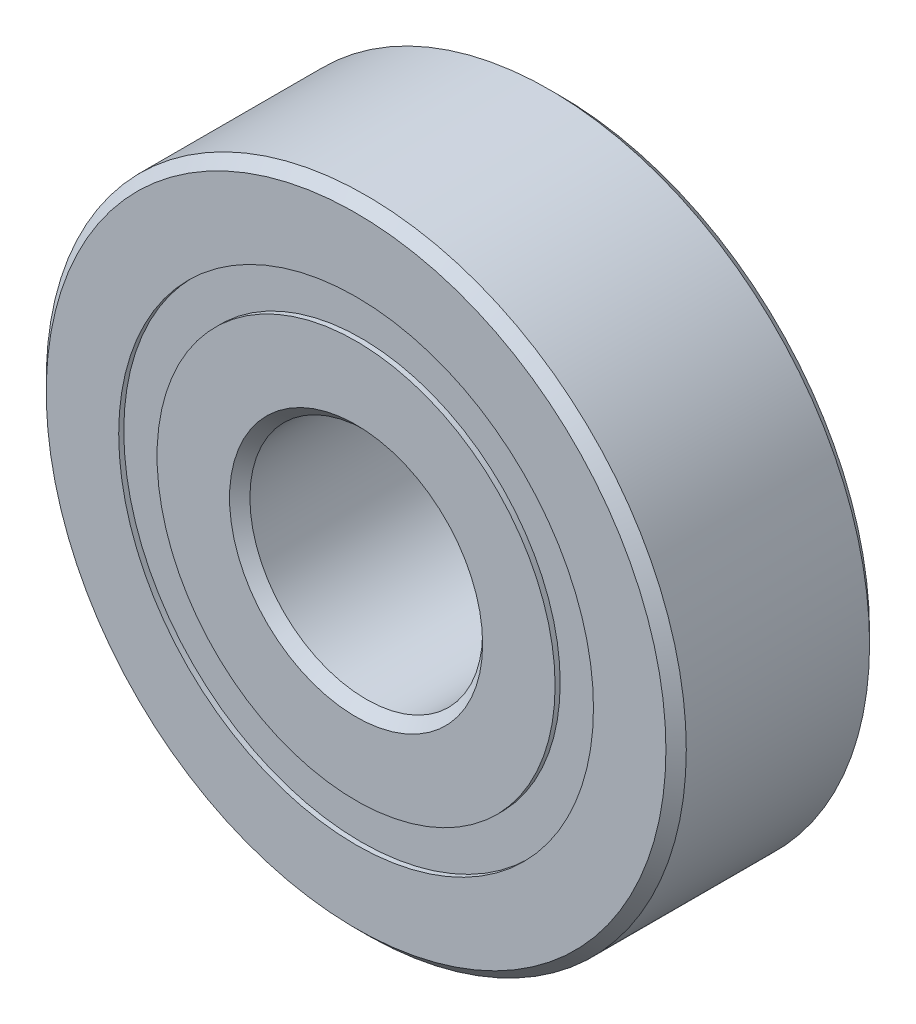
ISO-10303-21;
HEADER;
FILE_DESCRIPTION(('STEP AP214'),'2;1');
FILE_NAME('part.step','',(''),(''),'','','');
FILE_SCHEMA(('AUTOMOTIVE_DESIGN { 1 0 10303 214 1 1 1 1 }'));
ENDSEC;
DATA;
#1=APPLICATION_CONTEXT('core data for automotive mechanical design processes');
#2=APPLICATION_PROTOCOL_DEFINITION('international standard','automotive_design',2000,#1);
#3=PRODUCT_CONTEXT('',#1,'mechanical');
#4=PRODUCT('Part','Part','',(#3));
#5=PRODUCT_RELATED_PRODUCT_CATEGORY('part','',(#4));
#6=PRODUCT_DEFINITION_FORMATION('','',#4);
#7=PRODUCT_DEFINITION_CONTEXT('part definition',#1,'design');
#8=PRODUCT_DEFINITION('design','',#6,#7);
#9=PRODUCT_DEFINITION_SHAPE('','',#8);
#10=(LENGTH_UNIT() NAMED_UNIT(*) SI_UNIT(.MILLI.,.METRE.));
#11=(NAMED_UNIT(*) PLANE_ANGLE_UNIT() SI_UNIT($,.RADIAN.));
#12=(NAMED_UNIT(*) SI_UNIT($,.STERADIAN.) SOLID_ANGLE_UNIT());
#13=UNCERTAINTY_MEASURE_WITH_UNIT(LENGTH_MEASURE(1.E-05),#10,'distance_accuracy_value','');
#14=(GEOMETRIC_REPRESENTATION_CONTEXT(3) GLOBAL_UNCERTAINTY_ASSIGNED_CONTEXT((#13)) GLOBAL_UNIT_ASSIGNED_CONTEXT((#10,
#11,#12)) REPRESENTATION_CONTEXT('',''));
#15=CARTESIAN_POINT('',(0.,0.,0.));
#16=DIRECTION('',(0.,0.,1.));
#17=DIRECTION('',(1.,0.,0.));
#18=AXIS2_PLACEMENT_3D('',#15,#16,#17);
#19=CARTESIAN_POINT('',(0.,8.15934065934066,-3.325));
#20=DIRECTION('',(0.,0.,1.));
#21=DIRECTION('',(1.,0.,0.));
#22=AXIS2_PLACEMENT_3D('',#19,#20,#21);
#23=PLANE('',#22);
#24=CARTESIAN_POINT('',(0.,0.,-3.325));
#25=DIRECTION('',(0.,0.,1.));
#26=DIRECTION('',(1.,0.,0.));
#27=AXIS2_PLACEMENT_3D('',#24,#25,#26);
#28=CIRCLE('',#27,8.15934065934066);
#29=CARTESIAN_POINT('',(8.15934065934066,0.,-3.325));
#30=VERTEX_POINT('',#29);
#31=EDGE_CURVE('E55',#30,#30,#28,.T.);
#32=ORIENTED_EDGE('',*,*,#31,.F.);
#33=EDGE_LOOP('',(#32));
#34=FACE_BOUND('',#33,.T.);
#35=CARTESIAN_POINT('',(0.,0.,-3.325));
#36=DIRECTION('',(0.,0.,1.));
#37=DIRECTION('',(1.,0.,0.));
#38=AXIS2_PLACEMENT_3D('',#35,#36,#37);
#39=CIRCLE('',#38,6.84065934065934);
#40=CARTESIAN_POINT('',(6.84065934065934,0.,-3.325));
#41=VERTEX_POINT('',#40);
#42=EDGE_CURVE('E11',#41,#41,#39,.T.);
#43=ORIENTED_EDGE('',*,*,#42,.T.);
#44=EDGE_LOOP('',(#43));
#45=FACE_BOUND('',#44,.T.);
#46=ADVANCED_FACE('F41',(#34,#45),#23,.F.);
#47=CARTESIAN_POINT('',(0.,0.,3.5));
#48=DIRECTION('',(0.,0.,1.));
#49=DIRECTION('',(1.,0.,0.));
#50=AXIS2_PLACEMENT_3D('',#47,#48,#49);
#51=CYLINDRICAL_SURFACE('',#50,6.84065934065934);
#52=ORIENTED_EDGE('',*,*,#42,.F.);
#53=EDGE_LOOP('',(#52));
#54=FACE_BOUND('',#53,.T.);
#55=CARTESIAN_POINT('',(0.,0.,-1.68952158656808));
#56=DIRECTION('',(0.,0.,1.));
#57=DIRECTION('',(1.,0.,0.));
#58=AXIS2_PLACEMENT_3D('',#55,#56,#57);
#59=CIRCLE('',#58,6.84065934065934);
#60=CARTESIAN_POINT('',(6.84065934065934,0.,-1.68952158656808));
#61=VERTEX_POINT('',#60);
#62=EDGE_CURVE('E47',#61,#61,#59,.T.);
#63=ORIENTED_EDGE('',*,*,#62,.T.);
#64=EDGE_LOOP('',(#63));
#65=FACE_BOUND('',#64,.T.);
#66=ADVANCED_FACE('F64',(#54,#65),#51,.F.);
#67=CARTESIAN_POINT('',(0.,8.15934065934066,-1.68952158656808));
#68=DIRECTION('',(0.,0.,-1.));
#69=DIRECTION('',(-1.,0.,0.));
#70=AXIS2_PLACEMENT_3D('',#67,#68,#69);
#71=PLANE('',#70);
#72=ORIENTED_EDGE('',*,*,#62,.F.);
#73=EDGE_LOOP('',(#72));
#74=FACE_BOUND('',#73,.T.);
#75=CARTESIAN_POINT('',(0.,0.,-1.68952158656808));
#76=DIRECTION('',(0.,0.,1.));
#77=DIRECTION('',(1.,0.,0.));
#78=AXIS2_PLACEMENT_3D('',#75,#76,#77);
#79=CIRCLE('',#78,8.15934065934066);
#80=CARTESIAN_POINT('',(8.15934065934066,0.,-1.68952158656808));
#81=VERTEX_POINT('',#80);
#82=EDGE_CURVE('E51',#81,#81,#79,.T.);
#83=ORIENTED_EDGE('',*,*,#82,.T.);
#84=EDGE_LOOP('',(#83));
#85=FACE_BOUND('',#84,.T.);
#86=ADVANCED_FACE('F68',(#74,#85),#71,.F.);
#87=CARTESIAN_POINT('',(0.,0.,3.5));
#88=DIRECTION('',(0.,0.,1.));
#89=DIRECTION('',(1.,0.,0.));
#90=AXIS2_PLACEMENT_3D('',#87,#88,#89);
#91=CYLINDRICAL_SURFACE('',#90,8.15934065934066);
#92=ORIENTED_EDGE('',*,*,#82,.F.);
#93=EDGE_LOOP('',(#92));
#94=FACE_BOUND('',#93,.T.);
#95=ORIENTED_EDGE('',*,*,#31,.T.);
#96=EDGE_LOOP('',(#95));
#97=FACE_BOUND('',#96,.T.);
#98=ADVANCED_FACE('F61',(#94,#97),#91,.T.);
#99=CLOSED_SHELL('',(#46,#66,#86,#98));
#100=MANIFOLD_SOLID_BREP('B2',#99);
#101=CARTESIAN_POINT('',(0.,8.15934065934066,3.325));
#102=DIRECTION('',(0.,0.,-1.));
#103=DIRECTION('',(-1.,0.,0.));
#104=AXIS2_PLACEMENT_3D('',#101,#102,#103);
#105=PLANE('',#104);
#106=CARTESIAN_POINT('',(0.,0.,3.325));
#107=DIRECTION('',(0.,0.,1.));
#108=DIRECTION('',(1.,0.,0.));
#109=AXIS2_PLACEMENT_3D('',#106,#107,#108);
#110=CIRCLE('',#109,6.84065934065934);
#111=CARTESIAN_POINT('',(6.84065934065934,0.,3.325));
#112=VERTEX_POINT('',#111);
#113=EDGE_CURVE('E40',#112,#112,#110,.T.);
#114=ORIENTED_EDGE('',*,*,#113,.F.);
#115=EDGE_LOOP('',(#114));
#116=FACE_BOUND('',#115,.T.);
#117=CARTESIAN_POINT('',(0.,0.,3.325));
#118=DIRECTION('',(0.,0.,1.));
#119=DIRECTION('',(1.,0.,0.));
#120=AXIS2_PLACEMENT_3D('',#117,#118,#119);
#121=CIRCLE('',#120,8.15934065934066);
#122=CARTESIAN_POINT('',(8.15934065934066,0.,3.325));
#123=VERTEX_POINT('',#122);
#124=EDGE_CURVE('E122',#123,#123,#121,.T.);
#125=ORIENTED_EDGE('',*,*,#124,.T.);
#126=EDGE_LOOP('',(#125));
#127=FACE_BOUND('',#126,.T.);
#128=ADVANCED_FACE('F108',(#116,#127),#105,.F.);
#129=CARTESIAN_POINT('',(0.,0.,3.5));
#130=DIRECTION('',(0.,0.,1.));
#131=DIRECTION('',(1.,0.,0.));
#132=AXIS2_PLACEMENT_3D('',#129,#130,#131);
#133=CYLINDRICAL_SURFACE('',#132,6.84065934065934);
#134=CARTESIAN_POINT('',(0.,0.,1.68952158656808));
#135=DIRECTION('',(0.,0.,1.));
#136=DIRECTION('',(1.,0.,0.));
#137=AXIS2_PLACEMENT_3D('',#134,#135,#136);
#138=CIRCLE('',#137,6.84065934065934);
#139=CARTESIAN_POINT('',(6.84065934065934,0.,1.68952158656808));
#140=VERTEX_POINT('',#139);
#141=EDGE_CURVE('E114',#140,#140,#138,.T.);
#142=ORIENTED_EDGE('',*,*,#141,.F.);
#143=EDGE_LOOP('',(#142));
#144=FACE_BOUND('',#143,.T.);
#145=ORIENTED_EDGE('',*,*,#113,.T.);
#146=EDGE_LOOP('',(#145));
#147=FACE_BOUND('',#146,.T.);
#148=ADVANCED_FACE('F137',(#144,#147),#133,.F.);
#149=CARTESIAN_POINT('',(0.,8.15934065934066,1.68952158656808));
#150=DIRECTION('',(0.,0.,1.));
#151=DIRECTION('',(1.,0.,0.));
#152=AXIS2_PLACEMENT_3D('',#149,#150,#151);
#153=PLANE('',#152);
#154=CARTESIAN_POINT('',(0.,0.,1.68952158656808));
#155=DIRECTION('',(0.,0.,1.));
#156=DIRECTION('',(1.,0.,0.));
#157=AXIS2_PLACEMENT_3D('',#154,#155,#156);
#158=CIRCLE('',#157,8.15934065934066);
#159=CARTESIAN_POINT('',(8.15934065934066,0.,1.68952158656808));
#160=VERTEX_POINT('',#159);
#161=EDGE_CURVE('E118',#160,#160,#158,.T.);
#162=ORIENTED_EDGE('',*,*,#161,.F.);
#163=EDGE_LOOP('',(#162));
#164=FACE_BOUND('',#163,.T.);
#165=ORIENTED_EDGE('',*,*,#141,.T.);
#166=EDGE_LOOP('',(#165));
#167=FACE_BOUND('',#166,.T.);
#168=ADVANCED_FACE('F132',(#164,#167),#153,.F.);
#169=CARTESIAN_POINT('',(0.,0.,3.5));
#170=DIRECTION('',(0.,0.,1.));
#171=DIRECTION('',(1.,0.,0.));
#172=AXIS2_PLACEMENT_3D('',#169,#170,#171);
#173=CYLINDRICAL_SURFACE('',#172,8.15934065934066);
#174=ORIENTED_EDGE('',*,*,#124,.F.);
#175=EDGE_LOOP('',(#174));
#176=FACE_BOUND('',#175,.T.);
#177=ORIENTED_EDGE('',*,*,#161,.T.);
#178=EDGE_LOOP('',(#177));
#179=FACE_BOUND('',#178,.T.);
#180=ADVANCED_FACE('F129',(#176,#179),#173,.T.);
#181=CLOSED_SHELL('',(#128,#148,#168,#180));
#182=MANIFOLD_SOLID_BREP('B6',#181);
#183=CARTESIAN_POINT('',(-3.2541280433816,6.75726650926819,0.));
#184=DIRECTION('',(0.,0.,1.));
#185=DIRECTION('',(-0.433883739117546,0.900968867902425,0.));
#186=AXIS2_PLACEMENT_3D('',#183,#184,#185);
#187=SPHERICAL_SURFACE('',#186,1.68952158656808);
#188=CARTESIAN_POINT('',(-3.2541280433816,6.75726650926819,1.68952158656808));
#189=VERTEX_POINT('',#188);
#190=VERTEX_LOOP('',#189);
#191=FACE_BOUND('',#190,.T.);
#192=ADVANCED_FACE('F175',(#191),#187,.T.);
#193=CLOSED_SHELL('',(#192));
#194=MANIFOLD_SOLID_BREP('B35',#193);
#195=CARTESIAN_POINT('',(-5.86373611851017,4.67617351394057,0.));
#196=DIRECTION('',(0.,0.,1.));
#197=DIRECTION('',(-0.781831482468022,0.623489801858743,0.));
#198=AXIS2_PLACEMENT_3D('',#195,#196,#197);
#199=SPHERICAL_SURFACE('',#198,1.68952158656808);
#200=CARTESIAN_POINT('',(-5.86373611851017,4.67617351394057,1.68952158656808));
#201=VERTEX_POINT('',#200);
#202=VERTEX_LOOP('',#201);
#203=FACE_BOUND('',#202,.T.);
#204=ADVANCED_FACE('F195',(#203),#199,.T.);
#205=CLOSED_SHELL('',(#204));
#206=MANIFOLD_SOLID_BREP('B104',#205);
#207=CARTESIAN_POINT('',(-7.31195934136366,1.66890700467243,0.));
#208=DIRECTION('',(0.,0.,1.));
#209=DIRECTION('',(-0.974927912181821,0.222520933956325,0.));
#210=AXIS2_PLACEMENT_3D('',#207,#208,#209);
#211=SPHERICAL_SURFACE('',#210,1.68952158656808);
#212=CARTESIAN_POINT('',(-7.31195934136366,1.66890700467243,1.68952158656808));
#213=VERTEX_POINT('',#212);
#214=VERTEX_LOOP('',#213);
#215=FACE_BOUND('',#214,.T.);
#216=ADVANCED_FACE('F215',(#215),#211,.T.);
#217=CLOSED_SHELL('',(#216));
#218=MANIFOLD_SOLID_BREP('B171',#217);
#219=CARTESIAN_POINT('',(-7.31195934136369,-1.66890700467229,0.));
#220=DIRECTION('',(0.,0.,1.));
#221=DIRECTION('',(-0.974927912181826,-0.222520933956305,0.));
#222=AXIS2_PLACEMENT_3D('',#219,#220,#221);
#223=SPHERICAL_SURFACE('',#222,1.68952158656808);
#224=CARTESIAN_POINT('',(-7.31195934136369,-1.66890700467229,1.68952158656808));
#225=VERTEX_POINT('',#224);
#226=VERTEX_LOOP('',#225);
#227=FACE_BOUND('',#226,.T.);
#228=ADVANCED_FACE('F235',(#227),#223,.T.);
#229=CLOSED_SHELL('',(#228));
#230=MANIFOLD_SOLID_BREP('B191',#229);
#231=CARTESIAN_POINT('',(-5.86373611851026,-4.67617351394045,0.));
#232=DIRECTION('',(0.,0.,1.));
#233=DIRECTION('',(-0.781831482468035,-0.623489801858727,0.));
#234=AXIS2_PLACEMENT_3D('',#231,#232,#233);
#235=SPHERICAL_SURFACE('',#234,1.68952158656808);
#236=CARTESIAN_POINT('',(-5.86373611851026,-4.67617351394045,1.68952158656808));
#237=VERTEX_POINT('',#236);
#238=VERTEX_LOOP('',#237);
#239=FACE_BOUND('',#238,.T.);
#240=ADVANCED_FACE('F255',(#239),#235,.T.);
#241=CLOSED_SHELL('',(#240));
#242=MANIFOLD_SOLID_BREP('B211',#241);
#243=CARTESIAN_POINT('',(-3.25412804338174,-6.75726650926812,0.));
#244=DIRECTION('',(0.,0.,1.));
#245=DIRECTION('',(-0.433883739117565,-0.900968867902416,0.));
#246=AXIS2_PLACEMENT_3D('',#243,#244,#245);
#247=SPHERICAL_SURFACE('',#246,1.68952158656808);
#248=CARTESIAN_POINT('',(-3.25412804338174,-6.75726650926812,1.68952158656808));
#249=VERTEX_POINT('',#248);
#250=VERTEX_LOOP('',#249);
#251=FACE_BOUND('',#250,.T.);
#252=ADVANCED_FACE('F275',(#251),#247,.T.);
#253=CLOSED_SHELL('',(#252));
#254=MANIFOLD_SOLID_BREP('B231',#253);
#255=CARTESIAN_POINT('',(0.,-7.5,0.));
#256=DIRECTION('',(0.,0.,1.));
#257=DIRECTION('',(0.,-1.,0.));
#258=AXIS2_PLACEMENT_3D('',#255,#256,#257);
#259=SPHERICAL_SURFACE('',#258,1.68952158656808);
#260=CARTESIAN_POINT('',(0.,-7.5,1.68952158656808));
#261=VERTEX_POINT('',#260);
#262=VERTEX_LOOP('',#261);
#263=FACE_BOUND('',#262,.T.);
#264=ADVANCED_FACE('F295',(#263),#259,.T.);
#265=CLOSED_SHELL('',(#264));
#266=MANIFOLD_SOLID_BREP('B251',#265);
#267=CARTESIAN_POINT('',(3.25412804338164,-6.75726650926816,0.));
#268=DIRECTION('',(0.,0.,1.));
#269=DIRECTION('',(0.433883739117553,-0.900968867902422,0.));
#270=AXIS2_PLACEMENT_3D('',#267,#268,#269);
#271=SPHERICAL_SURFACE('',#270,1.68952158656808);
#272=CARTESIAN_POINT('',(3.25412804338164,-6.75726650926816,1.68952158656808));
#273=VERTEX_POINT('',#272);
#274=VERTEX_LOOP('',#273);
#275=FACE_BOUND('',#274,.T.);
#276=ADVANCED_FACE('F315',(#275),#271,.T.);
#277=CLOSED_SHELL('',(#276));
#278=MANIFOLD_SOLID_BREP('B271',#277);
#279=CARTESIAN_POINT('',(5.8637361185102,-4.67617351394053,0.));
#280=DIRECTION('',(0.,0.,1.));
#281=DIRECTION('',(0.781831482468027,-0.623489801858737,0.));
#282=AXIS2_PLACEMENT_3D('',#279,#280,#281);
#283=SPHERICAL_SURFACE('',#282,1.68952158656808);
#284=CARTESIAN_POINT('',(5.8637361185102,-4.67617351394053,1.68952158656808));
#285=VERTEX_POINT('',#284);
#286=VERTEX_LOOP('',#285);
#287=FACE_BOUND('',#286,.T.);
#288=ADVANCED_FACE('F335',(#287),#283,.T.);
#289=CLOSED_SHELL('',(#288));
#290=MANIFOLD_SOLID_BREP('B291',#289);
#291=CARTESIAN_POINT('',(7.31195934136367,-1.66890700467239,0.));
#292=DIRECTION('',(0.,0.,1.));
#293=DIRECTION('',(0.974927912181823,-0.222520933956318,0.));
#294=AXIS2_PLACEMENT_3D('',#291,#292,#293);
#295=SPHERICAL_SURFACE('',#294,1.68952158656808);
#296=CARTESIAN_POINT('',(7.31195934136367,-1.66890700467239,1.68952158656808));
#297=VERTEX_POINT('',#296);
#298=VERTEX_LOOP('',#297);
#299=FACE_BOUND('',#298,.T.);
#300=ADVANCED_FACE('F355',(#299),#295,.T.);
#301=CLOSED_SHELL('',(#300));
#302=MANIFOLD_SOLID_BREP('B311',#301);
#303=CARTESIAN_POINT('',(7.31195934136368,1.66890700467234,0.));
#304=DIRECTION('',(0.,0.,1.));
#305=DIRECTION('',(0.974927912181824,0.222520933956311,0.));
#306=AXIS2_PLACEMENT_3D('',#303,#304,#305);
#307=SPHERICAL_SURFACE('',#306,1.68952158656808);
#308=CARTESIAN_POINT('',(7.31195934136368,1.66890700467234,1.68952158656808));
#309=VERTEX_POINT('',#308);
#310=VERTEX_LOOP('',#309);
#311=FACE_BOUND('',#310,.T.);
#312=ADVANCED_FACE('F375',(#311),#307,.T.);
#313=CLOSED_SHELL('',(#312));
#314=MANIFOLD_SOLID_BREP('B331',#313);
#315=CARTESIAN_POINT('',(5.86373611851023,4.67617351394049,0.));
#316=DIRECTION('',(0.,0.,1.));
#317=DIRECTION('',(0.781831482468031,0.623489801858732,0.));
#318=AXIS2_PLACEMENT_3D('',#315,#316,#317);
#319=SPHERICAL_SURFACE('',#318,1.68952158656808);
#320=CARTESIAN_POINT('',(5.86373611851023,4.67617351394049,1.68952158656808));
#321=VERTEX_POINT('',#320);
#322=VERTEX_LOOP('',#321);
#323=FACE_BOUND('',#322,.T.);
#324=ADVANCED_FACE('F395',(#323),#319,.T.);
#325=CLOSED_SHELL('',(#324));
#326=MANIFOLD_SOLID_BREP('B351',#325);
#327=CARTESIAN_POINT('',(3.25412804338169,6.75726650926814,0.));
#328=DIRECTION('',(0.,0.,1.));
#329=DIRECTION('',(0.433883739117559,0.900968867902419,0.));
#330=AXIS2_PLACEMENT_3D('',#327,#328,#329);
#331=SPHERICAL_SURFACE('',#330,1.68952158656808);
#332=CARTESIAN_POINT('',(3.25412804338169,6.75726650926814,1.68952158656808));
#333=VERTEX_POINT('',#332);
#334=VERTEX_LOOP('',#333);
#335=FACE_BOUND('',#334,.T.);
#336=ADVANCED_FACE('F415',(#335),#331,.T.);
#337=CLOSED_SHELL('',(#336));
#338=MANIFOLD_SOLID_BREP('B371',#337);
#339=CARTESIAN_POINT('',(0.,7.5,0.));
#340=DIRECTION('',(0.,0.,1.));
#341=DIRECTION('',(0.,1.,0.));
#342=AXIS2_PLACEMENT_3D('',#339,#340,#341);
#343=SPHERICAL_SURFACE('',#342,1.68952158656808);
#344=CARTESIAN_POINT('',(0.,7.5,1.68952158656808));
#345=VERTEX_POINT('',#344);
#346=VERTEX_LOOP('',#345);
#347=FACE_BOUND('',#346,.T.);
#348=ADVANCED_FACE('F437',(#347),#343,.T.);
#349=CLOSED_SHELL('',(#348));
#350=MANIFOLD_SOLID_BREP('B391',#349);
#351=CARTESIAN_POINT('',(0.,6.84065934065934,3.5));
#352=DIRECTION('',(0.,0.,-1.));
#353=DIRECTION('',(-1.,0.,0.));
#354=AXIS2_PLACEMENT_3D('',#351,#352,#353);
#355=PLANE('',#354);
#356=CARTESIAN_POINT('',(0.,0.,3.5));
#357=DIRECTION('',(0.,0.,1.));
#358=DIRECTION('',(1.,0.,0.));
#359=AXIS2_PLACEMENT_3D('',#356,#357,#358);
#360=CIRCLE('',#359,4.35);
#361=CARTESIAN_POINT('',(4.35,0.,3.5));
#362=VERTEX_POINT('',#361);
#363=EDGE_CURVE('E484',#362,#362,#360,.T.);
#364=ORIENTED_EDGE('',*,*,#363,.F.);
#365=EDGE_LOOP('',(#364));
#366=FACE_BOUND('',#365,.T.);
#367=CARTESIAN_POINT('',(0.,0.,3.5));
#368=DIRECTION('',(0.,0.,1.));
#369=DIRECTION('',(1.,0.,0.));
#370=AXIS2_PLACEMENT_3D('',#367,#368,#369);
#371=CIRCLE('',#370,6.84065934065934);
#372=CARTESIAN_POINT('',(6.84065934065934,0.,3.5));
#373=VERTEX_POINT('',#372);
#374=EDGE_CURVE('E436',#373,#373,#371,.T.);
#375=ORIENTED_EDGE('',*,*,#374,.T.);
#376=EDGE_LOOP('',(#375));
#377=FACE_BOUND('',#376,.T.);
#378=ADVANCED_FACE('F456',(#366,#377),#355,.F.);
#379=CARTESIAN_POINT('',(0.,0.,3.5));
#380=DIRECTION('',(0.,0.,1.));
#381=DIRECTION('',(1.,0.,0.));
#382=AXIS2_PLACEMENT_3D('',#379,#380,#381);
#383=CYLINDRICAL_SURFACE('',#382,6.84065934065934);
#384=ORIENTED_EDGE('',*,*,#374,.F.);
#385=EDGE_LOOP('',(#384));
#386=FACE_BOUND('',#385,.T.);
#387=CARTESIAN_POINT('',(0.,0.,1.55555555555556));
#388=DIRECTION('',(0.,0.,1.));
#389=DIRECTION('',(1.,0.,0.));
#390=AXIS2_PLACEMENT_3D('',#387,#388,#389);
#391=CIRCLE('',#390,6.84065934065934);
#392=CARTESIAN_POINT('',(6.84065934065934,0.,1.55555555555556));
#393=VERTEX_POINT('',#392);
#394=EDGE_CURVE('E462',#393,#393,#391,.T.);
#395=ORIENTED_EDGE('',*,*,#394,.T.);
#396=EDGE_LOOP('',(#395));
#397=FACE_BOUND('',#396,.T.);
#398=ADVANCED_FACE('F491',(#386,#397),#383,.T.);
#399=CARTESIAN_POINT('',(0.,0.,0.));
#400=DIRECTION('',(0.,0.,1.));
#401=DIRECTION('',(1.,0.,0.));
#402=AXIS2_PLACEMENT_3D('',#399,#400,#401);
#403=TOROIDAL_SURFACE('',#402,7.49999999999999,1.68952158656808);
#404=ORIENTED_EDGE('',*,*,#394,.F.);
#405=EDGE_LOOP('',(#404));
#406=FACE_BOUND('',#405,.T.);
#407=CARTESIAN_POINT('',(0.,0.,-1.55555555555556));
#408=DIRECTION('',(0.,0.,1.));
#409=DIRECTION('',(1.,0.,0.));
#410=AXIS2_PLACEMENT_3D('',#407,#408,#409);
#411=CIRCLE('',#410,6.84065934065934);
#412=CARTESIAN_POINT('',(6.84065934065934,0.,-1.55555555555556));
#413=VERTEX_POINT('',#412);
#414=EDGE_CURVE('E466',#413,#413,#411,.T.);
#415=ORIENTED_EDGE('',*,*,#414,.T.);
#416=EDGE_LOOP('',(#415));
#417=FACE_BOUND('',#416,.T.);
#418=ADVANCED_FACE('F495',(#406,#417),#403,.F.);
#419=CARTESIAN_POINT('',(0.,0.,3.5));
#420=DIRECTION('',(0.,0.,1.));
#421=DIRECTION('',(1.,0.,0.));
#422=AXIS2_PLACEMENT_3D('',#419,#420,#421);
#423=CYLINDRICAL_SURFACE('',#422,6.84065934065934);
#424=ORIENTED_EDGE('',*,*,#414,.F.);
#425=EDGE_LOOP('',(#424));
#426=FACE_BOUND('',#425,.T.);
#427=CARTESIAN_POINT('',(0.,0.,-3.5));
#428=DIRECTION('',(0.,0.,1.));
#429=DIRECTION('',(1.,0.,0.));
#430=AXIS2_PLACEMENT_3D('',#427,#428,#429);
#431=CIRCLE('',#430,6.84065934065934);
#432=CARTESIAN_POINT('',(6.84065934065934,0.,-3.5));
#433=VERTEX_POINT('',#432);
#434=EDGE_CURVE('E470',#433,#433,#431,.T.);
#435=ORIENTED_EDGE('',*,*,#434,.T.);
#436=EDGE_LOOP('',(#435));
#437=FACE_BOUND('',#436,.T.);
#438=ADVANCED_FACE('F500',(#426,#437),#423,.T.);
#439=CARTESIAN_POINT('',(0.,4.35,-3.5));
#440=DIRECTION('',(0.,0.,1.));
#441=DIRECTION('',(1.,0.,0.));
#442=AXIS2_PLACEMENT_3D('',#439,#440,#441);
#443=PLANE('',#442);
#444=ORIENTED_EDGE('',*,*,#434,.F.);
#445=EDGE_LOOP('',(#444));
#446=FACE_BOUND('',#445,.T.);
#447=CARTESIAN_POINT('',(0.,0.,-3.5));
#448=DIRECTION('',(0.,0.,1.));
#449=DIRECTION('',(1.,0.,0.));
#450=AXIS2_PLACEMENT_3D('',#447,#448,#449);
#451=CIRCLE('',#450,4.35);
#452=CARTESIAN_POINT('',(4.35,0.,-3.5));
#453=VERTEX_POINT('',#452);
#454=EDGE_CURVE('E475',#453,#453,#451,.T.);
#455=ORIENTED_EDGE('',*,*,#454,.T.);
#456=EDGE_LOOP('',(#455));
#457=FACE_BOUND('',#456,.T.);
#458=ADVANCED_FACE('F506',(#446,#457),#443,.F.);
#459=CARTESIAN_POINT('',(0.,0.,-3.15));
#460=DIRECTION('',(0.,0.,-1.));
#461=DIRECTION('',(-1.,0.,0.));
#462=AXIS2_PLACEMENT_3D('',#459,#460,#461);
#463=CONICAL_SURFACE('',#462,4.,0.785398163397448);
#464=ORIENTED_EDGE('',*,*,#454,.F.);
#465=EDGE_LOOP('',(#464));
#466=FACE_BOUND('',#465,.T.);
#467=CARTESIAN_POINT('',(0.,0.,-3.15));
#468=DIRECTION('',(0.,0.,1.));
#469=DIRECTION('',(1.,0.,0.));
#470=AXIS2_PLACEMENT_3D('',#467,#468,#469);
#471=CIRCLE('',#470,4.);
#472=CARTESIAN_POINT('',(4.,0.,-3.15));
#473=VERTEX_POINT('',#472);
#474=EDGE_CURVE('E478',#473,#473,#471,.T.);
#475=ORIENTED_EDGE('',*,*,#474,.T.);
#476=EDGE_LOOP('',(#475));
#477=FACE_BOUND('',#476,.T.);
#478=ADVANCED_FACE('F510',(#466,#477),#463,.F.);
#479=CARTESIAN_POINT('',(0.,0.,3.5));
#480=DIRECTION('',(0.,0.,1.));
#481=DIRECTION('',(1.,0.,0.));
#482=AXIS2_PLACEMENT_3D('',#479,#480,#481);
#483=CYLINDRICAL_SURFACE('',#482,4.);
#484=ORIENTED_EDGE('',*,*,#474,.F.);
#485=EDGE_LOOP('',(#484));
#486=FACE_BOUND('',#485,.T.);
#487=CARTESIAN_POINT('',(0.,0.,3.15));
#488=DIRECTION('',(0.,0.,1.));
#489=DIRECTION('',(1.,0.,0.));
#490=AXIS2_PLACEMENT_3D('',#487,#488,#489);
#491=CIRCLE('',#490,4.);
#492=CARTESIAN_POINT('',(4.,0.,3.15));
#493=VERTEX_POINT('',#492);
#494=EDGE_CURVE('E481',#493,#493,#491,.T.);
#495=ORIENTED_EDGE('',*,*,#494,.T.);
#496=EDGE_LOOP('',(#495));
#497=FACE_BOUND('',#496,.T.);
#498=ADVANCED_FACE('F514',(#486,#497),#483,.F.);
#499=CARTESIAN_POINT('',(0.,0.,3.5));
#500=DIRECTION('',(0.,0.,1.));
#501=DIRECTION('',(1.,0.,0.));
#502=AXIS2_PLACEMENT_3D('',#499,#500,#501);
#503=CONICAL_SURFACE('',#502,4.35,0.785398163397448);
#504=ORIENTED_EDGE('',*,*,#494,.F.);
#505=EDGE_LOOP('',(#504));
#506=FACE_BOUND('',#505,.T.);
#507=ORIENTED_EDGE('',*,*,#363,.T.);
#508=EDGE_LOOP('',(#507));
#509=FACE_BOUND('',#508,.T.);
#510=ADVANCED_FACE('F488',(#506,#509),#503,.F.);
#511=CLOSED_SHELL('',(#378,#398,#418,#438,#458,#478,#498,#510));
#512=MANIFOLD_SOLID_BREP('B411',#511);
#513=CARTESIAN_POINT('',(0.,0.,3.15));
#514=DIRECTION('',(0.,0.,-1.));
#515=DIRECTION('',(-1.,0.,0.));
#516=AXIS2_PLACEMENT_3D('',#513,#514,#515);
#517=CONICAL_SURFACE('',#516,11.,0.785398163397448);
#518=CARTESIAN_POINT('',(0.,0.,3.5));
#519=DIRECTION('',(0.,0.,1.));
#520=DIRECTION('',(1.,0.,0.));
#521=AXIS2_PLACEMENT_3D('',#518,#519,#520);
#522=CIRCLE('',#521,10.65);
#523=CARTESIAN_POINT('',(10.65,0.,3.5));
#524=VERTEX_POINT('',#523);
#525=EDGE_CURVE('E605',#524,#524,#522,.T.);
#526=ORIENTED_EDGE('',*,*,#525,.F.);
#527=EDGE_LOOP('',(#526));
#528=FACE_BOUND('',#527,.T.);
#529=CARTESIAN_POINT('',(0.,0.,3.15));
#530=DIRECTION('',(0.,0.,1.));
#531=DIRECTION('',(1.,0.,0.));
#532=AXIS2_PLACEMENT_3D('',#529,#530,#531);
#533=CIRCLE('',#532,11.);
#534=CARTESIAN_POINT('',(11.,0.,3.15));
#535=VERTEX_POINT('',#534);
#536=EDGE_CURVE('E455',#535,#535,#533,.T.);
#537=ORIENTED_EDGE('',*,*,#536,.T.);
#538=EDGE_LOOP('',(#537));
#539=FACE_BOUND('',#538,.T.);
#540=ADVANCED_FACE('F577',(#528,#539),#517,.T.);
#541=CARTESIAN_POINT('',(0.,0.,3.5));
#542=DIRECTION('',(0.,0.,1.));
#543=DIRECTION('',(1.,0.,0.));
#544=AXIS2_PLACEMENT_3D('',#541,#542,#543);
#545=CYLINDRICAL_SURFACE('',#544,11.);
#546=ORIENTED_EDGE('',*,*,#536,.F.);
#547=EDGE_LOOP('',(#546));
#548=FACE_BOUND('',#547,.T.);
#549=CARTESIAN_POINT('',(0.,0.,-3.15));
#550=DIRECTION('',(0.,0.,1.));
#551=DIRECTION('',(1.,0.,0.));
#552=AXIS2_PLACEMENT_3D('',#549,#550,#551);
#553=CIRCLE('',#552,11.);
#554=CARTESIAN_POINT('',(11.,0.,-3.15));
#555=VERTEX_POINT('',#554);
#556=EDGE_CURVE('E583',#555,#555,#553,.T.);
#557=ORIENTED_EDGE('',*,*,#556,.T.);
#558=EDGE_LOOP('',(#557));
#559=FACE_BOUND('',#558,.T.);
#560=ADVANCED_FACE('F612',(#548,#559),#545,.T.);
#561=CARTESIAN_POINT('',(0.,0.,-3.5));
#562=DIRECTION('',(0.,0.,1.));
#563=DIRECTION('',(1.,0.,0.));
#564=AXIS2_PLACEMENT_3D('',#561,#562,#563);
#565=CONICAL_SURFACE('',#564,10.65,0.785398163397448);
#566=ORIENTED_EDGE('',*,*,#556,.F.);
#567=EDGE_LOOP('',(#566));
#568=FACE_BOUND('',#567,.T.);
#569=CARTESIAN_POINT('',(0.,0.,-3.5));
#570=DIRECTION('',(0.,0.,1.));
#571=DIRECTION('',(1.,0.,0.));
#572=AXIS2_PLACEMENT_3D('',#569,#570,#571);
#573=CIRCLE('',#572,10.65);
#574=CARTESIAN_POINT('',(10.65,0.,-3.5));
#575=VERTEX_POINT('',#574);
#576=EDGE_CURVE('E587',#575,#575,#573,.T.);
#577=ORIENTED_EDGE('',*,*,#576,.T.);
#578=EDGE_LOOP('',(#577));
#579=FACE_BOUND('',#578,.T.);
#580=ADVANCED_FACE('F616',(#568,#579),#565,.T.);
#581=CARTESIAN_POINT('',(0.,10.65,-3.5));
#582=DIRECTION('',(0.,0.,1.));
#583=DIRECTION('',(1.,0.,0.));
#584=AXIS2_PLACEMENT_3D('',#581,#582,#583);
#585=PLANE('',#584);
#586=ORIENTED_EDGE('',*,*,#576,.F.);
#587=EDGE_LOOP('',(#586));
#588=FACE_BOUND('',#587,.T.);
#589=CARTESIAN_POINT('',(0.,0.,-3.5));
#590=DIRECTION('',(0.,0.,1.));
#591=DIRECTION('',(1.,0.,0.));
#592=AXIS2_PLACEMENT_3D('',#589,#590,#591);
#593=CIRCLE('',#592,8.15934065934066);
#594=CARTESIAN_POINT('',(8.15934065934066,0.,-3.5));
#595=VERTEX_POINT('',#594);
#596=EDGE_CURVE('E591',#595,#595,#593,.T.);
#597=ORIENTED_EDGE('',*,*,#596,.T.);
#598=EDGE_LOOP('',(#597));
#599=FACE_BOUND('',#598,.T.);
#600=ADVANCED_FACE('F621',(#588,#599),#585,.F.);
#601=CARTESIAN_POINT('',(0.,0.,3.5));
#602=DIRECTION('',(0.,0.,1.));
#603=DIRECTION('',(1.,0.,0.));
#604=AXIS2_PLACEMENT_3D('',#601,#602,#603);
#605=CYLINDRICAL_SURFACE('',#604,8.15934065934066);
#606=ORIENTED_EDGE('',*,*,#596,.F.);
#607=EDGE_LOOP('',(#606));
#608=FACE_BOUND('',#607,.T.);
#609=CARTESIAN_POINT('',(0.,0.,-1.55555555555556));
#610=DIRECTION('',(0.,0.,1.));
#611=DIRECTION('',(1.,0.,0.));
#612=AXIS2_PLACEMENT_3D('',#609,#610,#611);
#613=CIRCLE('',#612,8.15934065934066);
#614=CARTESIAN_POINT('',(8.15934065934066,0.,-1.55555555555556));
#615=VERTEX_POINT('',#614);
#616=EDGE_CURVE('E596',#615,#615,#613,.T.);
#617=ORIENTED_EDGE('',*,*,#616,.T.);
#618=EDGE_LOOP('',(#617));
#619=FACE_BOUND('',#618,.T.);
#620=ADVANCED_FACE('F627',(#608,#619),#605,.F.);
#621=CARTESIAN_POINT('',(0.,0.,0.));
#622=DIRECTION('',(0.,0.,1.));
#623=DIRECTION('',(1.,0.,0.));
#624=AXIS2_PLACEMENT_3D('',#621,#622,#623);
#625=TOROIDAL_SURFACE('',#624,7.5,1.68952158656808);
#626=ORIENTED_EDGE('',*,*,#616,.F.);
#627=EDGE_LOOP('',(#626));
#628=FACE_BOUND('',#627,.T.);
#629=CARTESIAN_POINT('',(0.,0.,1.55555555555556));
#630=DIRECTION('',(0.,0.,1.));
#631=DIRECTION('',(1.,0.,0.));
#632=AXIS2_PLACEMENT_3D('',#629,#630,#631);
#633=CIRCLE('',#632,8.15934065934066);
#634=CARTESIAN_POINT('',(8.15934065934066,0.,1.55555555555556));
#635=VERTEX_POINT('',#634);
#636=EDGE_CURVE('E599',#635,#635,#633,.T.);
#637=ORIENTED_EDGE('',*,*,#636,.T.);
#638=EDGE_LOOP('',(#637));
#639=FACE_BOUND('',#638,.T.);
#640=ADVANCED_FACE('F631',(#628,#639),#625,.F.);
#641=CARTESIAN_POINT('',(0.,0.,3.5));
#642=DIRECTION('',(0.,0.,1.));
#643=DIRECTION('',(1.,0.,0.));
#644=AXIS2_PLACEMENT_3D('',#641,#642,#643);
#645=CYLINDRICAL_SURFACE('',#644,8.15934065934066);
#646=ORIENTED_EDGE('',*,*,#636,.F.);
#647=EDGE_LOOP('',(#646));
#648=FACE_BOUND('',#647,.T.);
#649=CARTESIAN_POINT('',(0.,0.,3.5));
#650=DIRECTION('',(0.,0.,1.));
#651=DIRECTION('',(1.,0.,0.));
#652=AXIS2_PLACEMENT_3D('',#649,#650,#651);
#653=CIRCLE('',#652,8.15934065934066);
#654=CARTESIAN_POINT('',(8.15934065934066,0.,3.5));
#655=VERTEX_POINT('',#654);
#656=EDGE_CURVE('E602',#655,#655,#653,.T.);
#657=ORIENTED_EDGE('',*,*,#656,.T.);
#658=EDGE_LOOP('',(#657));
#659=FACE_BOUND('',#658,.T.);
#660=ADVANCED_FACE('F635',(#648,#659),#645,.F.);
#661=CARTESIAN_POINT('',(0.,10.65,3.5));
#662=DIRECTION('',(0.,0.,-1.));
#663=DIRECTION('',(-1.,0.,0.));
#664=AXIS2_PLACEMENT_3D('',#661,#662,#663);
#665=PLANE('',#664);
#666=ORIENTED_EDGE('',*,*,#656,.F.);
#667=EDGE_LOOP('',(#666));
#668=FACE_BOUND('',#667,.T.);
#669=ORIENTED_EDGE('',*,*,#525,.T.);
#670=EDGE_LOOP('',(#669));
#671=FACE_BOUND('',#670,.T.);
#672=ADVANCED_FACE('F609',(#668,#671),#665,.F.);
#673=CLOSED_SHELL('',(#540,#560,#580,#600,#620,#640,#660,#672));
#674=MANIFOLD_SOLID_BREP('B431',#673);
#675=ADVANCED_BREP_SHAPE_REPRESENTATION('',(#18,#100,#182,#194,#206,#218,#230,#242,#254,#266,
#278,#290,#302,#314,#326,#338,#350,#512,#674),#14);
#676=SHAPE_DEFINITION_REPRESENTATION(#9,#675);
ENDSEC;
END-ISO-10303-21;
